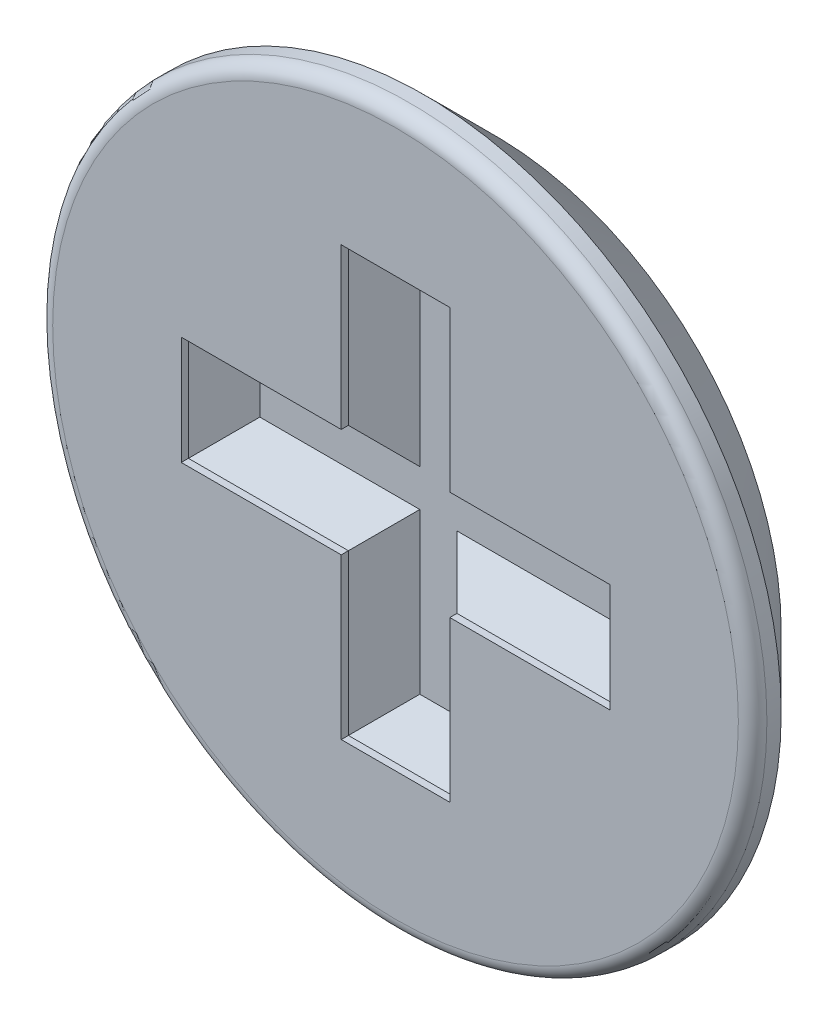
ISO-10303-21;
HEADER;
FILE_DESCRIPTION(('STEP AP214'),'2;1');
FILE_NAME('part.step','',(''),(''),'','','');
FILE_SCHEMA(('AUTOMOTIVE_DESIGN { 1 0 10303 214 1 1 1 1 }'));
ENDSEC;
DATA;
#1=APPLICATION_CONTEXT('core data for automotive mechanical design processes');
#2=APPLICATION_PROTOCOL_DEFINITION('international standard','automotive_design',2000,#1);
#3=PRODUCT_CONTEXT('',#1,'mechanical');
#4=PRODUCT('Part','Part','',(#3));
#5=PRODUCT_RELATED_PRODUCT_CATEGORY('part','',(#4));
#6=PRODUCT_DEFINITION_FORMATION('','',#4);
#7=PRODUCT_DEFINITION_CONTEXT('part definition',#1,'design');
#8=PRODUCT_DEFINITION('design','',#6,#7);
#9=PRODUCT_DEFINITION_SHAPE('','',#8);
#10=(LENGTH_UNIT() NAMED_UNIT(*) SI_UNIT(.MILLI.,.METRE.));
#11=(NAMED_UNIT(*) PLANE_ANGLE_UNIT() SI_UNIT($,.RADIAN.));
#12=(NAMED_UNIT(*) SI_UNIT($,.STERADIAN.) SOLID_ANGLE_UNIT());
#13=UNCERTAINTY_MEASURE_WITH_UNIT(LENGTH_MEASURE(1.E-05),#10,'distance_accuracy_value','');
#14=(GEOMETRIC_REPRESENTATION_CONTEXT(3) GLOBAL_UNCERTAINTY_ASSIGNED_CONTEXT((#13)) GLOBAL_UNIT_ASSIGNED_CONTEXT((#10,
#11,#12)) REPRESENTATION_CONTEXT('',''));
#15=CARTESIAN_POINT('',(0.,0.,0.));
#16=DIRECTION('',(0.,0.,1.));
#17=DIRECTION('',(1.,0.,0.));
#18=AXIS2_PLACEMENT_3D('',#15,#16,#17);
#19=CARTESIAN_POINT('',(-0.625,-0.625,0.2));
#20=DIRECTION('',(0.,0.,1.));
#21=DIRECTION('',(1.,0.,0.));
#22=AXIS2_PLACEMENT_3D('',#19,#20,#21);
#23=PLANE('',#22);
#24=DIRECTION('',(1.,0.,0.));
#25=VECTOR('',#24,1.);
#26=CARTESIAN_POINT('',(-0.4075,-0.065,0.2));
#27=LINE('',#26,#25);
#28=CARTESIAN_POINT('',(-0.6249999999524,-0.065,0.2));
#29=VERTEX_POINT('',#28);
#30=CARTESIAN_POINT('',(-0.065,-0.0649999999575301,0.2));
#31=VERTEX_POINT('',#30);
#32=EDGE_CURVE('E221',#29,#31,#27,.T.);
#33=ORIENTED_EDGE('',*,*,#32,.T.);
#34=DIRECTION('',(0.,-1.,0.));
#35=VECTOR('',#34,1.);
#36=CARTESIAN_POINT('',(-0.065,-0.4075,0.2));
#37=LINE('',#36,#35);
#38=CARTESIAN_POINT('',(-0.06499999994095,-0.625,0.2));
#39=VERTEX_POINT('',#38);
#40=EDGE_CURVE('E213',#31,#39,#37,.T.);
#41=ORIENTED_EDGE('',*,*,#40,.T.);
#42=DIRECTION('',(1.,0.,0.));
#43=VECTOR('',#42,1.);
#44=CARTESIAN_POINT('',(0.,-0.625,0.2));
#45=LINE('',#44,#43);
#46=CARTESIAN_POINT('',(0.065,-0.6249999999524,0.2));
#47=VERTEX_POINT('',#46);
#48=EDGE_CURVE('E205',#39,#47,#45,.T.);
#49=ORIENTED_EDGE('',*,*,#48,.T.);
#50=DIRECTION('',(0.,1.,0.));
#51=VECTOR('',#50,1.);
#52=CARTESIAN_POINT('',(0.065,-0.4075,0.2));
#53=LINE('',#52,#51);
#54=CARTESIAN_POINT('',(0.0649999999575301,-0.065,0.2));
#55=VERTEX_POINT('',#54);
#56=EDGE_CURVE('E197',#47,#55,#53,.T.);
#57=ORIENTED_EDGE('',*,*,#56,.T.);
#58=DIRECTION('',(1.,0.,0.));
#59=VECTOR('',#58,1.);
#60=CARTESIAN_POINT('',(0.4075,-0.065,0.2));
#61=LINE('',#60,#59);
#62=CARTESIAN_POINT('',(0.625,-0.06499999994095,0.2));
#63=VERTEX_POINT('',#62);
#64=EDGE_CURVE('E189',#55,#63,#61,.T.);
#65=ORIENTED_EDGE('',*,*,#64,.T.);
#66=DIRECTION('',(0.,1.,0.));
#67=VECTOR('',#66,1.);
#68=CARTESIAN_POINT('',(0.625,0.,0.2));
#69=LINE('',#68,#67);
#70=CARTESIAN_POINT('',(0.6249999999524,0.065,0.2));
#71=VERTEX_POINT('',#70);
#72=EDGE_CURVE('E181',#63,#71,#69,.T.);
#73=ORIENTED_EDGE('',*,*,#72,.T.);
#74=DIRECTION('',(-1.,0.,0.));
#75=VECTOR('',#74,1.);
#76=CARTESIAN_POINT('',(0.4075,0.065,0.2));
#77=LINE('',#76,#75);
#78=CARTESIAN_POINT('',(0.065,0.0649999999575301,0.2));
#79=VERTEX_POINT('',#78);
#80=EDGE_CURVE('E163',#71,#79,#77,.T.);
#81=ORIENTED_EDGE('',*,*,#80,.T.);
#82=DIRECTION('',(0.,1.,0.));
#83=VECTOR('',#82,1.);
#84=CARTESIAN_POINT('',(0.065,0.4075,0.2));
#85=LINE('',#84,#83);
#86=CARTESIAN_POINT('',(0.06499999994095,0.625,0.2));
#87=VERTEX_POINT('',#86);
#88=EDGE_CURVE('E144',#79,#87,#85,.T.);
#89=ORIENTED_EDGE('',*,*,#88,.T.);
#90=DIRECTION('',(-1.,0.,0.));
#91=VECTOR('',#90,1.);
#92=CARTESIAN_POINT('',(0.,0.625,0.2));
#93=LINE('',#92,#91);
#94=CARTESIAN_POINT('',(-0.065,0.6249999999524,0.2));
#95=VERTEX_POINT('',#94);
#96=EDGE_CURVE('E139',#87,#95,#93,.T.);
#97=ORIENTED_EDGE('',*,*,#96,.T.);
#98=DIRECTION('',(0.,-1.,0.));
#99=VECTOR('',#98,1.);
#100=CARTESIAN_POINT('',(-0.065,0.4075,0.2));
#101=LINE('',#100,#99);
#102=CARTESIAN_POINT('',(-0.065,0.06499999995753,0.2));
#103=VERTEX_POINT('',#102);
#104=EDGE_CURVE('E141',#95,#103,#101,.T.);
#105=ORIENTED_EDGE('',*,*,#104,.T.);
#106=DIRECTION('',(-1.,0.,0.));
#107=VECTOR('',#106,1.);
#108=CARTESIAN_POINT('',(-0.4075,0.065,0.2));
#109=LINE('',#108,#107);
#110=CARTESIAN_POINT('',(-0.625,0.06499999994095,0.2));
#111=VERTEX_POINT('',#110);
#112=EDGE_CURVE('E237',#103,#111,#109,.T.);
#113=ORIENTED_EDGE('',*,*,#112,.T.);
#114=DIRECTION('',(0.,-1.,0.));
#115=VECTOR('',#114,1.);
#116=CARTESIAN_POINT('',(-0.625,0.,0.2));
#117=LINE('',#116,#115);
#118=EDGE_CURVE('E229',#111,#29,#117,.T.);
#119=ORIENTED_EDGE('',*,*,#118,.T.);
#120=EDGE_LOOP('',(#33,#41,#49,#57,#65,#73,#81,#89,#97,#105,#113,#119));
#121=FACE_BOUND('',#120,.T.);
#122=ADVANCED_FACE('F16',(#121),#23,.T.);
#123=CARTESIAN_POINT('',(-1.012,-1.012,0.));
#124=DIRECTION('',(0.,0.,1.));
#125=DIRECTION('',(1.,0.,0.));
#126=AXIS2_PLACEMENT_3D('',#123,#124,#125);
#127=PLANE('',#126);
#128=CARTESIAN_POINT('',(0.,0.,0.));
#129=DIRECTION('',(0.,0.,1.));
#130=DIRECTION('',(1.,0.,0.));
#131=AXIS2_PLACEMENT_3D('',#128,#129,#130);
#132=CIRCLE('',#131,1.);
#133=CARTESIAN_POINT('',(1.,0.,0.));
#134=VERTEX_POINT('',#133);
#135=EDGE_CURVE('E247',#134,#134,#132,.F.);
#136=ORIENTED_EDGE('',*,*,#135,.T.);
#137=EDGE_LOOP('',(#136));
#138=FACE_BOUND('',#137,.T.);
#139=ADVANCED_FACE('F430',(#138),#127,.F.);
#140=CARTESIAN_POINT('',(-0.065,0.06089,0.2));
#141=DIRECTION('',(-0.707106781186548,0.,-0.707106781186547));
#142=DIRECTION('',(-0.707106781186547,0.,0.707106781186548));
#143=AXIS2_PLACEMENT_3D('',#140,#141,#142);
#144=PLANE('',#143);
#145=DIRECTION('',(0.,-1.,0.));
#146=VECTOR('',#145,1.);
#147=CARTESIAN_POINT('',(-0.19,0.47,0.325));
#148=LINE('',#147,#146);
#149=CARTESIAN_POINT('',(-0.19,0.75000000002356,0.325));
#150=VERTEX_POINT('',#149);
#151=CARTESIAN_POINT('',(-0.19,0.19000000005905,0.325));
#152=VERTEX_POINT('',#151);
#153=EDGE_CURVE('E250',#150,#152,#148,.T.);
#154=ORIENTED_EDGE('',*,*,#153,.T.);
#155=DIRECTION('',(0.577350268877025,-0.577350269814827,-0.577350268877026));
#156=VECTOR('',#155,1.);
#157=CARTESIAN_POINT('',(-0.1899999998819,0.19,0.3249999998819));
#158=LINE('',#157,#156);
#159=EDGE_CURVE('E154',#152,#103,#158,.T.);
#160=ORIENTED_EDGE('',*,*,#159,.T.);
#161=ORIENTED_EDGE('',*,*,#104,.F.);
#162=DIRECTION('',(-0.57735026897051,0.577350269627857,0.57735026897051));
#163=VECTOR('',#162,1.);
#164=CARTESIAN_POINT('',(-0.0650000000952,0.625,0.2000000000952));
#165=LINE('',#164,#163);
#166=EDGE_CURVE('E20',#95,#150,#165,.T.);
#167=ORIENTED_EDGE('',*,*,#166,.T.);
#168=EDGE_LOOP('',(#154,#160,#161,#167));
#169=FACE_BOUND('',#168,.T.);
#170=ADVANCED_FACE('F151',(#169),#144,.F.);
#171=CARTESIAN_POINT('',(-0.19228,0.625,0.2));
#172=DIRECTION('',(0.,0.707106781186548,-0.707106781186547));
#173=DIRECTION('',(0.,0.707106781186547,0.707106781186548));
#174=AXIS2_PLACEMENT_3D('',#171,#172,#173);
#175=PLANE('',#174);
#176=ORIENTED_EDGE('',*,*,#96,.F.);
#177=DIRECTION('',(0.577350269814827,0.577350268877025,0.577350268877025));
#178=VECTOR('',#177,1.);
#179=CARTESIAN_POINT('',(0.065,0.6250000001181,0.2000000001181));
#180=LINE('',#179,#178);
#181=CARTESIAN_POINT('',(0.19000000004247,0.75,0.325));
#182=VERTEX_POINT('',#181);
#183=EDGE_CURVE('E161',#87,#182,#180,.T.);
#184=ORIENTED_EDGE('',*,*,#183,.T.);
#185=DIRECTION('',(-1.,0.,0.));
#186=VECTOR('',#185,1.);
#187=CARTESIAN_POINT('',(0.,0.75,0.325));
#188=LINE('',#187,#186);
#189=EDGE_CURVE('E159',#182,#150,#188,.T.);
#190=ORIENTED_EDGE('',*,*,#189,.T.);
#191=ORIENTED_EDGE('',*,*,#166,.F.);
#192=EDGE_LOOP('',(#176,#184,#190,#191));
#193=FACE_BOUND('',#192,.T.);
#194=ADVANCED_FACE('F157',(#193),#175,.F.);
#195=CARTESIAN_POINT('',(0.19,0.06089,0.325));
#196=DIRECTION('',(0.707106781186548,0.,-0.707106781186547));
#197=DIRECTION('',(-0.707106781186547,0.,-0.707106781186548));
#198=AXIS2_PLACEMENT_3D('',#195,#196,#197);
#199=PLANE('',#198);
#200=ORIENTED_EDGE('',*,*,#88,.F.);
#201=DIRECTION('',(0.577350268877025,0.577350269814827,0.577350268877026));
#202=VECTOR('',#201,1.);
#203=CARTESIAN_POINT('',(0.06500000008494,0.065,0.20000000008494));
#204=LINE('',#203,#202);
#205=CARTESIAN_POINT('',(0.19,0.19000000005905,0.325));
#206=VERTEX_POINT('',#205);
#207=EDGE_CURVE('E175',#79,#206,#204,.T.);
#208=ORIENTED_EDGE('',*,*,#207,.T.);
#209=DIRECTION('',(0.,1.,0.));
#210=VECTOR('',#209,1.);
#211=CARTESIAN_POINT('',(0.19,0.47,0.325));
#212=LINE('',#211,#210);
#213=EDGE_CURVE('E168',#206,#182,#212,.T.);
#214=ORIENTED_EDGE('',*,*,#213,.T.);
#215=ORIENTED_EDGE('',*,*,#183,.F.);
#216=EDGE_LOOP('',(#200,#208,#214,#215));
#217=FACE_BOUND('',#216,.T.);
#218=ADVANCED_FACE('F262',(#217),#199,.F.);
#219=CARTESIAN_POINT('',(0.06089,0.065,0.2));
#220=DIRECTION('',(0.,0.707106781186548,-0.707106781186547));
#221=DIRECTION('',(0.,0.707106781186547,0.707106781186548));
#222=AXIS2_PLACEMENT_3D('',#219,#220,#221);
#223=PLANE('',#222);
#224=ORIENTED_EDGE('',*,*,#80,.F.);
#225=DIRECTION('',(0.577350269627858,0.57735026897051,0.57735026897051));
#226=VECTOR('',#225,1.);
#227=CARTESIAN_POINT('',(0.625,0.0650000000952,0.2000000000952));
#228=LINE('',#227,#226);
#229=CARTESIAN_POINT('',(0.75000000002356,0.19,0.325));
#230=VERTEX_POINT('',#229);
#231=EDGE_CURVE('E183',#71,#230,#228,.T.);
#232=ORIENTED_EDGE('',*,*,#231,.T.);
#233=DIRECTION('',(-1.,0.,0.));
#234=VECTOR('',#233,1.);
#235=CARTESIAN_POINT('',(0.47,0.19,0.325));
#236=LINE('',#235,#234);
#237=EDGE_CURVE('E173',#230,#206,#236,.T.);
#238=ORIENTED_EDGE('',*,*,#237,.T.);
#239=ORIENTED_EDGE('',*,*,#207,.F.);
#240=EDGE_LOOP('',(#224,#232,#238,#239));
#241=FACE_BOUND('',#240,.T.);
#242=ADVANCED_FACE('F267',(#241),#223,.F.);
#243=CARTESIAN_POINT('',(0.75,-0.19228,0.325));
#244=DIRECTION('',(0.707106781186548,0.,-0.707106781186547));
#245=DIRECTION('',(-0.707106781186547,0.,-0.707106781186548));
#246=AXIS2_PLACEMENT_3D('',#243,#244,#245);
#247=PLANE('',#246);
#248=ORIENTED_EDGE('',*,*,#72,.F.);
#249=DIRECTION('',(0.577350268877025,-0.577350269814827,0.577350268877025));
#250=VECTOR('',#249,1.);
#251=CARTESIAN_POINT('',(0.6250000001181,-0.065,0.2000000001181));
#252=LINE('',#251,#250);
#253=CARTESIAN_POINT('',(0.75,-0.19000000004247,0.325));
#254=VERTEX_POINT('',#253);
#255=EDGE_CURVE('E191',#63,#254,#252,.T.);
#256=ORIENTED_EDGE('',*,*,#255,.T.);
#257=DIRECTION('',(0.,1.,0.));
#258=VECTOR('',#257,1.);
#259=CARTESIAN_POINT('',(0.75,0.,0.325));
#260=LINE('',#259,#258);
#261=EDGE_CURVE('E180',#254,#230,#260,.T.);
#262=ORIENTED_EDGE('',*,*,#261,.T.);
#263=ORIENTED_EDGE('',*,*,#231,.F.);
#264=EDGE_LOOP('',(#248,#256,#262,#263));
#265=FACE_BOUND('',#264,.T.);
#266=ADVANCED_FACE('F390',(#265),#247,.F.);
#267=CARTESIAN_POINT('',(0.06089,-0.19,0.325));
#268=DIRECTION('',(0.,-0.707106781186548,-0.707106781186547));
#269=DIRECTION('',(0.,0.707106781186547,-0.707106781186548));
#270=AXIS2_PLACEMENT_3D('',#267,#268,#269);
#271=PLANE('',#270);
#272=ORIENTED_EDGE('',*,*,#64,.F.);
#273=DIRECTION('',(0.577350269814827,-0.577350268877025,0.577350268877026));
#274=VECTOR('',#273,1.);
#275=CARTESIAN_POINT('',(0.065,-0.06500000008494,0.20000000008494));
#276=LINE('',#275,#274);
#277=CARTESIAN_POINT('',(0.19000000005905,-0.19,0.325));
#278=VERTEX_POINT('',#277);
#279=EDGE_CURVE('E199',#55,#278,#276,.T.);
#280=ORIENTED_EDGE('',*,*,#279,.T.);
#281=DIRECTION('',(1.,0.,0.));
#282=VECTOR('',#281,1.);
#283=CARTESIAN_POINT('',(0.47,-0.19,0.325));
#284=LINE('',#283,#282);
#285=EDGE_CURVE('E188',#278,#254,#284,.T.);
#286=ORIENTED_EDGE('',*,*,#285,.T.);
#287=ORIENTED_EDGE('',*,*,#255,.F.);
#288=EDGE_LOOP('',(#272,#280,#286,#287));
#289=FACE_BOUND('',#288,.T.);
#290=ADVANCED_FACE('F388',(#289),#271,.F.);
#291=CARTESIAN_POINT('',(0.19,-0.75411,0.325));
#292=DIRECTION('',(0.707106781186548,0.,-0.707106781186547));
#293=DIRECTION('',(-0.707106781186547,0.,-0.707106781186548));
#294=AXIS2_PLACEMENT_3D('',#291,#292,#293);
#295=PLANE('',#294);
#296=DIRECTION('',(0.,1.,0.));
#297=VECTOR('',#296,1.);
#298=CARTESIAN_POINT('',(0.19,-0.47,0.325));
#299=LINE('',#298,#297);
#300=CARTESIAN_POINT('',(0.19,-0.75000000002356,0.325));
#301=VERTEX_POINT('',#300);
#302=EDGE_CURVE('E196',#301,#278,#299,.T.);
#303=ORIENTED_EDGE('',*,*,#302,.T.);
#304=ORIENTED_EDGE('',*,*,#279,.F.);
#305=ORIENTED_EDGE('',*,*,#56,.F.);
#306=DIRECTION('',(0.57735026897051,-0.577350269627858,0.57735026897051));
#307=VECTOR('',#306,1.);
#308=CARTESIAN_POINT('',(0.0650000000952,-0.625,0.2000000000952));
#309=LINE('',#308,#307);
#310=EDGE_CURVE('E207',#47,#301,#309,.T.);
#311=ORIENTED_EDGE('',*,*,#310,.T.);
#312=EDGE_LOOP('',(#303,#304,#305,#311));
#313=FACE_BOUND('',#312,.T.);
#314=ADVANCED_FACE('F382',(#313),#295,.F.);
#315=CARTESIAN_POINT('',(-0.19228,-0.75,0.325));
#316=DIRECTION('',(0.,-0.707106781186548,-0.707106781186547));
#317=DIRECTION('',(0.,0.707106781186547,-0.707106781186548));
#318=AXIS2_PLACEMENT_3D('',#315,#316,#317);
#319=PLANE('',#318);
#320=DIRECTION('',(1.,0.,0.));
#321=VECTOR('',#320,1.);
#322=CARTESIAN_POINT('',(0.,-0.75,0.325));
#323=LINE('',#322,#321);
#324=CARTESIAN_POINT('',(-0.19000000004247,-0.75,0.325));
#325=VERTEX_POINT('',#324);
#326=EDGE_CURVE('E204',#325,#301,#323,.T.);
#327=ORIENTED_EDGE('',*,*,#326,.T.);
#328=ORIENTED_EDGE('',*,*,#310,.F.);
#329=ORIENTED_EDGE('',*,*,#48,.F.);
#330=DIRECTION('',(-0.577350269814827,-0.577350268877025,0.577350268877025));
#331=VECTOR('',#330,1.);
#332=CARTESIAN_POINT('',(-0.065,-0.6250000001181,0.2000000001181));
#333=LINE('',#332,#331);
#334=EDGE_CURVE('E215',#39,#325,#333,.T.);
#335=ORIENTED_EDGE('',*,*,#334,.T.);
#336=EDGE_LOOP('',(#327,#328,#329,#335));
#337=FACE_BOUND('',#336,.T.);
#338=ADVANCED_FACE('F380',(#337),#319,.F.);
#339=CARTESIAN_POINT('',(-0.065,-0.75411,0.2));
#340=DIRECTION('',(-0.707106781186548,0.,-0.707106781186547));
#341=DIRECTION('',(-0.707106781186547,0.,0.707106781186548));
#342=AXIS2_PLACEMENT_3D('',#339,#340,#341);
#343=PLANE('',#342);
#344=DIRECTION('',(0.,-1.,0.));
#345=VECTOR('',#344,1.);
#346=CARTESIAN_POINT('',(-0.19,-0.47,0.325));
#347=LINE('',#346,#345);
#348=CARTESIAN_POINT('',(-0.19,-0.19000000005905,0.325));
#349=VERTEX_POINT('',#348);
#350=EDGE_CURVE('E212',#349,#325,#347,.T.);
#351=ORIENTED_EDGE('',*,*,#350,.T.);
#352=ORIENTED_EDGE('',*,*,#334,.F.);
#353=ORIENTED_EDGE('',*,*,#40,.F.);
#354=DIRECTION('',(-0.577350268877025,-0.577350269814827,0.577350268877026));
#355=VECTOR('',#354,1.);
#356=CARTESIAN_POINT('',(-0.06500000008494,-0.0650000000000001,0.20000000008494));
#357=LINE('',#356,#355);
#358=EDGE_CURVE('E223',#31,#349,#357,.T.);
#359=ORIENTED_EDGE('',*,*,#358,.T.);
#360=EDGE_LOOP('',(#351,#352,#353,#359));
#361=FACE_BOUND('',#360,.T.);
#362=ADVANCED_FACE('F374',(#361),#343,.F.);
#363=CARTESIAN_POINT('',(-0.75411,-0.19,0.325));
#364=DIRECTION('',(0.,-0.707106781186548,-0.707106781186547));
#365=DIRECTION('',(0.,0.707106781186547,-0.707106781186548));
#366=AXIS2_PLACEMENT_3D('',#363,#364,#365);
#367=PLANE('',#366);
#368=DIRECTION('',(1.,0.,0.));
#369=VECTOR('',#368,1.);
#370=CARTESIAN_POINT('',(-0.47,-0.19,0.325));
#371=LINE('',#370,#369);
#372=CARTESIAN_POINT('',(-0.75000000002356,-0.19,0.325));
#373=VERTEX_POINT('',#372);
#374=EDGE_CURVE('E220',#373,#349,#371,.T.);
#375=ORIENTED_EDGE('',*,*,#374,.T.);
#376=ORIENTED_EDGE('',*,*,#358,.F.);
#377=ORIENTED_EDGE('',*,*,#32,.F.);
#378=DIRECTION('',(-0.577350269627857,-0.57735026897051,0.57735026897051));
#379=VECTOR('',#378,1.);
#380=CARTESIAN_POINT('',(-0.625,-0.0650000000952,0.2000000000952));
#381=LINE('',#380,#379);
#382=EDGE_CURVE('E231',#29,#373,#381,.T.);
#383=ORIENTED_EDGE('',*,*,#382,.T.);
#384=EDGE_LOOP('',(#375,#376,#377,#383));
#385=FACE_BOUND('',#384,.T.);
#386=ADVANCED_FACE('F372',(#385),#367,.F.);
#387=CARTESIAN_POINT('',(-0.625,-0.19228,0.2));
#388=DIRECTION('',(-0.707106781186548,0.,-0.707106781186547));
#389=DIRECTION('',(-0.707106781186547,0.,0.707106781186548));
#390=AXIS2_PLACEMENT_3D('',#387,#388,#389);
#391=PLANE('',#390);
#392=DIRECTION('',(0.,-1.,0.));
#393=VECTOR('',#392,1.);
#394=CARTESIAN_POINT('',(-0.75,0.,0.325));
#395=LINE('',#394,#393);
#396=CARTESIAN_POINT('',(-0.75,0.19000000004247,0.325));
#397=VERTEX_POINT('',#396);
#398=EDGE_CURVE('E228',#397,#373,#395,.T.);
#399=ORIENTED_EDGE('',*,*,#398,.T.);
#400=ORIENTED_EDGE('',*,*,#382,.F.);
#401=ORIENTED_EDGE('',*,*,#118,.F.);
#402=DIRECTION('',(-0.577350268877025,0.577350269814827,0.577350268877025));
#403=VECTOR('',#402,1.);
#404=CARTESIAN_POINT('',(-0.6250000001181,0.065,0.2000000001181));
#405=LINE('',#404,#403);
#406=EDGE_CURVE('E239',#111,#397,#405,.T.);
#407=ORIENTED_EDGE('',*,*,#406,.T.);
#408=EDGE_LOOP('',(#399,#400,#401,#407));
#409=FACE_BOUND('',#408,.T.);
#410=ADVANCED_FACE('F366',(#409),#391,.F.);
#411=CARTESIAN_POINT('',(-0.75411,0.065,0.2));
#412=DIRECTION('',(0.,0.707106781186548,-0.707106781186547));
#413=DIRECTION('',(0.,0.707106781186547,0.707106781186548));
#414=AXIS2_PLACEMENT_3D('',#411,#412,#413);
#415=PLANE('',#414);
#416=DIRECTION('',(-1.,0.,0.));
#417=VECTOR('',#416,1.);
#418=CARTESIAN_POINT('',(-0.47,0.19,0.325));
#419=LINE('',#418,#417);
#420=EDGE_CURVE('E240',#152,#397,#419,.T.);
#421=ORIENTED_EDGE('',*,*,#420,.T.);
#422=ORIENTED_EDGE('',*,*,#406,.F.);
#423=ORIENTED_EDGE('',*,*,#112,.F.);
#424=ORIENTED_EDGE('',*,*,#159,.F.);
#425=EDGE_LOOP('',(#421,#422,#423,#424));
#426=FACE_BOUND('',#425,.T.);
#427=ADVANCED_FACE('F313',(#426),#415,.F.);
#428=CARTESIAN_POINT('',(0.,0.,0.));
#429=DIRECTION('',(0.,0.,1.));
#430=DIRECTION('',(1.,0.,0.));
#431=AXIS2_PLACEMENT_3D('',#428,#429,#430);
#432=CONICAL_SURFACE('',#431,1.,0.785398163397448);
#433=ORIENTED_EDGE('',*,*,#135,.F.);
#434=EDGE_LOOP('',(#433));
#435=FACE_BOUND('',#434,.T.);
#436=CARTESIAN_POINT('',(0.,0.,0.25));
#437=DIRECTION('',(0.,0.,-1.));
#438=DIRECTION('',(-1.,0.,0.));
#439=AXIS2_PLACEMENT_3D('',#436,#437,#438);
#440=CIRCLE('',#439,1.25);
#441=CARTESIAN_POINT('',(-1.25,0.,0.25));
#442=VERTEX_POINT('',#441);
#443=EDGE_CURVE('E244',#442,#442,#440,.T.);
#444=ORIENTED_EDGE('',*,*,#443,.T.);
#445=EDGE_LOOP('',(#444));
#446=FACE_BOUND('',#445,.T.);
#447=ADVANCED_FACE('F415',(#435,#446),#432,.T.);
#448=CARTESIAN_POINT('',(-0.19,0.75,0.325));
#449=DIRECTION('',(-1.,0.,0.));
#450=DIRECTION('',(0.,-1.,0.));
#451=AXIS2_PLACEMENT_3D('',#448,#449,#450);
#452=PLANE('',#451);
#453=ORIENTED_EDGE('',*,*,#153,.F.);
#454=DIRECTION('',(0.,0.,1.));
#455=VECTOR('',#454,1.);
#456=CARTESIAN_POINT('',(-0.19,0.75,0.3375));
#457=LINE('',#456,#455);
#458=CARTESIAN_POINT('',(-0.1899999997032,0.7499999997552,0.35));
#459=VERTEX_POINT('',#458);
#460=EDGE_CURVE('E166',#150,#459,#457,.T.);
#461=ORIENTED_EDGE('',*,*,#460,.T.);
#462=DIRECTION('',(0.,1.,0.));
#463=VECTOR('',#462,1.);
#464=CARTESIAN_POINT('',(-0.1899999988128,0.,0.35));
#465=LINE('',#464,#463);
#466=CARTESIAN_POINT('',(-0.1899999997032,0.1899999997032,0.35));
#467=VERTEX_POINT('',#466);
#468=EDGE_CURVE('E295',#467,#459,#465,.T.);
#469=ORIENTED_EDGE('',*,*,#468,.F.);
#470=DIRECTION('',(0.,0.,-1.));
#471=VECTOR('',#470,1.);
#472=CARTESIAN_POINT('',(-0.19,0.19,0.3375));
#473=LINE('',#472,#471);
#474=EDGE_CURVE('E236',#467,#152,#473,.T.);
#475=ORIENTED_EDGE('',*,*,#474,.T.);
#476=EDGE_LOOP('',(#453,#461,#469,#475));
#477=FACE_BOUND('',#476,.T.);
#478=ADVANCED_FACE('F308',(#477),#452,.F.);
#479=CARTESIAN_POINT('',(-0.19,0.75,0.325));
#480=DIRECTION('',(0.,1.,0.));
#481=DIRECTION('',(0.,0.,1.));
#482=AXIS2_PLACEMENT_3D('',#479,#480,#481);
#483=PLANE('',#482);
#484=ORIENTED_EDGE('',*,*,#189,.F.);
#485=DIRECTION('',(0.,0.,1.));
#486=VECTOR('',#485,1.);
#487=CARTESIAN_POINT('',(0.19,0.75,0.3375));
#488=LINE('',#487,#486);
#489=CARTESIAN_POINT('',(0.1899999997032,0.7499999997552,0.35));
#490=VERTEX_POINT('',#489);
#491=EDGE_CURVE('E171',#182,#490,#488,.T.);
#492=ORIENTED_EDGE('',*,*,#491,.T.);
#493=DIRECTION('',(1.,0.,0.));
#494=VECTOR('',#493,1.);
#495=CARTESIAN_POINT('',(0.,0.7499999990208,0.35));
#496=LINE('',#495,#494);
#497=EDGE_CURVE('E293',#459,#490,#496,.T.);
#498=ORIENTED_EDGE('',*,*,#497,.F.);
#499=ORIENTED_EDGE('',*,*,#460,.F.);
#500=EDGE_LOOP('',(#484,#492,#498,#499));
#501=FACE_BOUND('',#500,.T.);
#502=ADVANCED_FACE('F423',(#501),#483,.F.);
#503=CARTESIAN_POINT('',(0.19,0.19,0.325));
#504=DIRECTION('',(1.,0.,0.));
#505=DIRECTION('',(0.,1.,0.));
#506=AXIS2_PLACEMENT_3D('',#503,#504,#505);
#507=PLANE('',#506);
#508=ORIENTED_EDGE('',*,*,#213,.F.);
#509=DIRECTION('',(0.,0.,1.));
#510=VECTOR('',#509,1.);
#511=CARTESIAN_POINT('',(0.19,0.19,0.3375));
#512=LINE('',#511,#510);
#513=CARTESIAN_POINT('',(0.1899999997032,0.1899999997032,0.35));
#514=VERTEX_POINT('',#513);
#515=EDGE_CURVE('E178',#206,#514,#512,.T.);
#516=ORIENTED_EDGE('',*,*,#515,.T.);
#517=DIRECTION('',(0.,-1.,0.));
#518=VECTOR('',#517,1.);
#519=CARTESIAN_POINT('',(0.1899999988128,0.,0.35));
#520=LINE('',#519,#518);
#521=EDGE_CURVE('E285',#490,#514,#520,.T.);
#522=ORIENTED_EDGE('',*,*,#521,.F.);
#523=ORIENTED_EDGE('',*,*,#491,.F.);
#524=EDGE_LOOP('',(#508,#516,#522,#523));
#525=FACE_BOUND('',#524,.T.);
#526=ADVANCED_FACE('F274',(#525),#507,.F.);
#527=CARTESIAN_POINT('',(0.75,0.19,0.325));
#528=DIRECTION('',(0.,1.,0.));
#529=DIRECTION('',(-1.,0.,0.));
#530=AXIS2_PLACEMENT_3D('',#527,#528,#529);
#531=PLANE('',#530);
#532=ORIENTED_EDGE('',*,*,#237,.F.);
#533=DIRECTION('',(0.,0.,1.));
#534=VECTOR('',#533,1.);
#535=CARTESIAN_POINT('',(0.75,0.19,0.3375));
#536=LINE('',#535,#534);
#537=CARTESIAN_POINT('',(0.7499999997552,0.1899999997032,0.35));
#538=VERTEX_POINT('',#537);
#539=EDGE_CURVE('E186',#230,#538,#536,.T.);
#540=ORIENTED_EDGE('',*,*,#539,.T.);
#541=DIRECTION('',(1.,0.,0.));
#542=VECTOR('',#541,1.);
#543=CARTESIAN_POINT('',(0.,0.1899999988128,0.35));
#544=LINE('',#543,#542);
#545=EDGE_CURVE('E279',#514,#538,#544,.T.);
#546=ORIENTED_EDGE('',*,*,#545,.F.);
#547=ORIENTED_EDGE('',*,*,#515,.F.);
#548=EDGE_LOOP('',(#532,#540,#546,#547));
#549=FACE_BOUND('',#548,.T.);
#550=ADVANCED_FACE('F277',(#549),#531,.F.);
#551=CARTESIAN_POINT('',(0.75,-0.19,0.35));
#552=DIRECTION('',(1.,0.,0.));
#553=DIRECTION('',(0.,0.,-1.));
#554=AXIS2_PLACEMENT_3D('',#551,#552,#553);
#555=PLANE('',#554);
#556=ORIENTED_EDGE('',*,*,#261,.F.);
#557=DIRECTION('',(0.,0.,1.));
#558=VECTOR('',#557,1.);
#559=CARTESIAN_POINT('',(0.75,-0.19,0.3375));
#560=LINE('',#559,#558);
#561=CARTESIAN_POINT('',(0.7499999997552,-0.1899999997032,0.35));
#562=VERTEX_POINT('',#561);
#563=EDGE_CURVE('E194',#254,#562,#560,.T.);
#564=ORIENTED_EDGE('',*,*,#563,.T.);
#565=DIRECTION('',(0.,-1.,0.));
#566=VECTOR('',#565,1.);
#567=CARTESIAN_POINT('',(0.7499999990208,0.,0.35));
#568=LINE('',#567,#566);
#569=EDGE_CURVE('E284',#538,#562,#568,.T.);
#570=ORIENTED_EDGE('',*,*,#569,.F.);
#571=ORIENTED_EDGE('',*,*,#539,.F.);
#572=EDGE_LOOP('',(#556,#564,#570,#571));
#573=FACE_BOUND('',#572,.T.);
#574=ADVANCED_FACE('F339',(#573),#555,.F.);
#575=CARTESIAN_POINT('',(0.19,-0.19,0.325));
#576=DIRECTION('',(0.,-1.,0.));
#577=DIRECTION('',(1.,0.,0.));
#578=AXIS2_PLACEMENT_3D('',#575,#576,#577);
#579=PLANE('',#578);
#580=ORIENTED_EDGE('',*,*,#285,.F.);
#581=DIRECTION('',(0.,0.,1.));
#582=VECTOR('',#581,1.);
#583=CARTESIAN_POINT('',(0.19,-0.19,0.3375));
#584=LINE('',#583,#582);
#585=CARTESIAN_POINT('',(0.1899999997032,-0.1899999997032,0.35));
#586=VERTEX_POINT('',#585);
#587=EDGE_CURVE('E202',#278,#586,#584,.T.);
#588=ORIENTED_EDGE('',*,*,#587,.T.);
#589=DIRECTION('',(-1.,0.,0.));
#590=VECTOR('',#589,1.);
#591=CARTESIAN_POINT('',(0.,-0.1899999988128,0.35));
#592=LINE('',#591,#590);
#593=EDGE_CURVE('E334',#562,#586,#592,.T.);
#594=ORIENTED_EDGE('',*,*,#593,.F.);
#595=ORIENTED_EDGE('',*,*,#563,.F.);
#596=EDGE_LOOP('',(#580,#588,#594,#595));
#597=FACE_BOUND('',#596,.T.);
#598=ADVANCED_FACE('F343',(#597),#579,.F.);
#599=CARTESIAN_POINT('',(0.19,-0.75,0.325));
#600=DIRECTION('',(1.,0.,0.));
#601=DIRECTION('',(0.,1.,0.));
#602=AXIS2_PLACEMENT_3D('',#599,#600,#601);
#603=PLANE('',#602);
#604=ORIENTED_EDGE('',*,*,#302,.F.);
#605=DIRECTION('',(0.,0.,1.));
#606=VECTOR('',#605,1.);
#607=CARTESIAN_POINT('',(0.19,-0.75,0.3375));
#608=LINE('',#607,#606);
#609=CARTESIAN_POINT('',(0.1899999997032,-0.7499999997552,0.35));
#610=VERTEX_POINT('',#609);
#611=EDGE_CURVE('E210',#301,#610,#608,.T.);
#612=ORIENTED_EDGE('',*,*,#611,.T.);
#613=DIRECTION('',(0.,-1.,0.));
#614=VECTOR('',#613,1.);
#615=CARTESIAN_POINT('',(0.1899999988128,0.,0.35));
#616=LINE('',#615,#614);
#617=EDGE_CURVE('E331',#586,#610,#616,.T.);
#618=ORIENTED_EDGE('',*,*,#617,.F.);
#619=ORIENTED_EDGE('',*,*,#587,.F.);
#620=EDGE_LOOP('',(#604,#612,#618,#619));
#621=FACE_BOUND('',#620,.T.);
#622=ADVANCED_FACE('F348',(#621),#603,.F.);
#623=CARTESIAN_POINT('',(-0.19,-0.75,0.35));
#624=DIRECTION('',(0.,-1.,0.));
#625=DIRECTION('',(0.,0.,-1.));
#626=AXIS2_PLACEMENT_3D('',#623,#624,#625);
#627=PLANE('',#626);
#628=ORIENTED_EDGE('',*,*,#326,.F.);
#629=DIRECTION('',(0.,0.,1.));
#630=VECTOR('',#629,1.);
#631=CARTESIAN_POINT('',(-0.19,-0.75,0.3375));
#632=LINE('',#631,#630);
#633=CARTESIAN_POINT('',(-0.1899999997032,-0.7499999997552,0.35));
#634=VERTEX_POINT('',#633);
#635=EDGE_CURVE('E218',#325,#634,#632,.T.);
#636=ORIENTED_EDGE('',*,*,#635,.T.);
#637=DIRECTION('',(-1.,0.,0.));
#638=VECTOR('',#637,1.);
#639=CARTESIAN_POINT('',(0.,-0.7499999990208,0.35));
#640=LINE('',#639,#638);
#641=EDGE_CURVE('E328',#610,#634,#640,.T.);
#642=ORIENTED_EDGE('',*,*,#641,.F.);
#643=ORIENTED_EDGE('',*,*,#611,.F.);
#644=EDGE_LOOP('',(#628,#636,#642,#643));
#645=FACE_BOUND('',#644,.T.);
#646=ADVANCED_FACE('F354',(#645),#627,.F.);
#647=CARTESIAN_POINT('',(-0.19,-0.19,0.325));
#648=DIRECTION('',(-1.,0.,0.));
#649=DIRECTION('',(0.,-1.,0.));
#650=AXIS2_PLACEMENT_3D('',#647,#648,#649);
#651=PLANE('',#650);
#652=ORIENTED_EDGE('',*,*,#350,.F.);
#653=DIRECTION('',(0.,0.,1.));
#654=VECTOR('',#653,1.);
#655=CARTESIAN_POINT('',(-0.19,-0.19,0.3375));
#656=LINE('',#655,#654);
#657=CARTESIAN_POINT('',(-0.1899999997032,-0.1899999997032,0.35));
#658=VERTEX_POINT('',#657);
#659=EDGE_CURVE('E226',#349,#658,#656,.T.);
#660=ORIENTED_EDGE('',*,*,#659,.T.);
#661=DIRECTION('',(0.,1.,0.));
#662=VECTOR('',#661,1.);
#663=CARTESIAN_POINT('',(-0.1899999988128,0.,0.35));
#664=LINE('',#663,#662);
#665=EDGE_CURVE('E324',#634,#658,#664,.T.);
#666=ORIENTED_EDGE('',*,*,#665,.F.);
#667=ORIENTED_EDGE('',*,*,#635,.F.);
#668=EDGE_LOOP('',(#652,#660,#666,#667));
#669=FACE_BOUND('',#668,.T.);
#670=ADVANCED_FACE('F358',(#669),#651,.F.);
#671=CARTESIAN_POINT('',(-0.75,-0.19,0.325));
#672=DIRECTION('',(0.,-1.,0.));
#673=DIRECTION('',(1.,0.,0.));
#674=AXIS2_PLACEMENT_3D('',#671,#672,#673);
#675=PLANE('',#674);
#676=ORIENTED_EDGE('',*,*,#374,.F.);
#677=DIRECTION('',(0.,0.,1.));
#678=VECTOR('',#677,1.);
#679=CARTESIAN_POINT('',(-0.75,-0.19,0.3375));
#680=LINE('',#679,#678);
#681=CARTESIAN_POINT('',(-0.7499999997552,-0.1899999997032,0.35));
#682=VERTEX_POINT('',#681);
#683=EDGE_CURVE('E234',#373,#682,#680,.T.);
#684=ORIENTED_EDGE('',*,*,#683,.T.);
#685=DIRECTION('',(-1.,0.,0.));
#686=VECTOR('',#685,1.);
#687=CARTESIAN_POINT('',(0.,-0.1899999988128,0.35));
#688=LINE('',#687,#686);
#689=EDGE_CURVE('E321',#658,#682,#688,.T.);
#690=ORIENTED_EDGE('',*,*,#689,.F.);
#691=ORIENTED_EDGE('',*,*,#659,.F.);
#692=EDGE_LOOP('',(#676,#684,#690,#691));
#693=FACE_BOUND('',#692,.T.);
#694=ADVANCED_FACE('F362',(#693),#675,.F.);
#695=CARTESIAN_POINT('',(-0.75,-0.19,0.325));
#696=DIRECTION('',(-1.,0.,0.));
#697=DIRECTION('',(0.,0.,1.));
#698=AXIS2_PLACEMENT_3D('',#695,#696,#697);
#699=PLANE('',#698);
#700=ORIENTED_EDGE('',*,*,#398,.F.);
#701=DIRECTION('',(0.,0.,1.));
#702=VECTOR('',#701,1.);
#703=CARTESIAN_POINT('',(-0.75,0.19,0.3375));
#704=LINE('',#703,#702);
#705=CARTESIAN_POINT('',(-0.7499999997552,0.1899999997032,0.35));
#706=VERTEX_POINT('',#705);
#707=EDGE_CURVE('E35',#397,#706,#704,.T.);
#708=ORIENTED_EDGE('',*,*,#707,.T.);
#709=DIRECTION('',(0.,1.,0.));
#710=VECTOR('',#709,1.);
#711=CARTESIAN_POINT('',(-0.7499999990208,0.,0.35));
#712=LINE('',#711,#710);
#713=EDGE_CURVE('E316',#682,#706,#712,.T.);
#714=ORIENTED_EDGE('',*,*,#713,.F.);
#715=ORIENTED_EDGE('',*,*,#683,.F.);
#716=EDGE_LOOP('',(#700,#708,#714,#715));
#717=FACE_BOUND('',#716,.T.);
#718=ADVANCED_FACE('F363',(#717),#699,.F.);
#719=CARTESIAN_POINT('',(-0.19,0.19,0.325));
#720=DIRECTION('',(0.,1.,0.));
#721=DIRECTION('',(-1.,0.,0.));
#722=AXIS2_PLACEMENT_3D('',#719,#720,#721);
#723=PLANE('',#722);
#724=ORIENTED_EDGE('',*,*,#420,.F.);
#725=ORIENTED_EDGE('',*,*,#474,.F.);
#726=DIRECTION('',(1.,0.,0.));
#727=VECTOR('',#726,1.);
#728=CARTESIAN_POINT('',(0.,0.1899999988128,0.35));
#729=LINE('',#728,#727);
#730=EDGE_CURVE('E302',#706,#467,#729,.T.);
#731=ORIENTED_EDGE('',*,*,#730,.F.);
#732=ORIENTED_EDGE('',*,*,#707,.F.);
#733=EDGE_LOOP('',(#724,#725,#731,#732));
#734=FACE_BOUND('',#733,.T.);
#735=ADVANCED_FACE('F315',(#734),#723,.F.);
#736=CARTESIAN_POINT('',(0.,0.,0.3));
#737=DIRECTION('',(0.,0.,-1.));
#738=DIRECTION('',(-1.,0.,0.));
#739=AXIS2_PLACEMENT_3D('',#736,#737,#738);
#740=CYLINDRICAL_SURFACE('',#739,1.25);
#741=CARTESIAN_POINT('',(0.,0.,0.3));
#742=DIRECTION('',(0.,0.,1.));
#743=DIRECTION('',(1.,0.,0.));
#744=AXIS2_PLACEMENT_3D('',#741,#742,#743);
#745=CIRCLE('',#744,1.25);
#746=CARTESIAN_POINT('',(1.25,0.,0.3));
#747=VERTEX_POINT('',#746);
#748=EDGE_CURVE('E26',#747,#747,#745,.T.);
#749=ORIENTED_EDGE('',*,*,#748,.F.);
#750=EDGE_LOOP('',(#749));
#751=FACE_BOUND('',#750,.T.);
#752=ORIENTED_EDGE('',*,*,#443,.F.);
#753=EDGE_LOOP('',(#752));
#754=FACE_BOUND('',#753,.T.);
#755=ADVANCED_FACE('F405',(#751,#754),#740,.T.);
#756=CARTESIAN_POINT('',(-1.2144,-1.2144,0.35));
#757=DIRECTION('',(0.,0.,1.));
#758=DIRECTION('',(1.,0.,0.));
#759=AXIS2_PLACEMENT_3D('',#756,#757,#758);
#760=PLANE('',#759);
#761=ORIENTED_EDGE('',*,*,#713,.T.);
#762=ORIENTED_EDGE('',*,*,#730,.T.);
#763=ORIENTED_EDGE('',*,*,#468,.T.);
#764=ORIENTED_EDGE('',*,*,#497,.T.);
#765=ORIENTED_EDGE('',*,*,#521,.T.);
#766=ORIENTED_EDGE('',*,*,#545,.T.);
#767=ORIENTED_EDGE('',*,*,#569,.T.);
#768=ORIENTED_EDGE('',*,*,#593,.T.);
#769=ORIENTED_EDGE('',*,*,#617,.T.);
#770=ORIENTED_EDGE('',*,*,#641,.T.);
#771=ORIENTED_EDGE('',*,*,#665,.T.);
#772=ORIENTED_EDGE('',*,*,#689,.T.);
#773=EDGE_LOOP('',(#761,#762,#763,#764,#765,#766,#767,#768,#769,#770,#771,#772));
#774=FACE_BOUND('',#773,.T.);
#775=CARTESIAN_POINT('',(0.,0.,0.35));
#776=DIRECTION('',(0.,0.,1.));
#777=DIRECTION('',(1.,0.,0.));
#778=AXIS2_PLACEMENT_3D('',#775,#776,#777);
#779=CIRCLE('',#778,1.20000000000316);
#780=CARTESIAN_POINT('',(1.20000000000316,0.,0.35));
#781=VERTEX_POINT('',#780);
#782=EDGE_CURVE('E10',#781,#781,#779,.F.);
#783=ORIENTED_EDGE('',*,*,#782,.F.);
#784=EDGE_LOOP('',(#783));
#785=FACE_BOUND('',#784,.T.);
#786=ADVANCED_FACE('F289',(#774,#785),#760,.T.);
#787=CARTESIAN_POINT('',(0.,0.,0.3));
#788=DIRECTION('',(0.,0.,1.));
#789=DIRECTION('',(1.,0.,0.));
#790=AXIS2_PLACEMENT_3D('',#787,#788,#789);
#791=TOROIDAL_SURFACE('',#790,1.2,0.0500000000000001);
#792=ORIENTED_EDGE('',*,*,#748,.T.);
#793=EDGE_LOOP('',(#792));
#794=FACE_BOUND('',#793,.T.);
#795=ORIENTED_EDGE('',*,*,#782,.T.);
#796=EDGE_LOOP('',(#795));
#797=FACE_BOUND('',#796,.T.);
#798=ADVANCED_FACE('F18',(#794,#797),#791,.T.);
#799=CLOSED_SHELL('',(#122,#139,#170,#194,#218,#242,#266,#290,#314,#338,#362,#386,#410,#427,
#447,#478,#502,#526,#550,#574,#598,#622,#646,#670,#694,#718,#735,#755,#786,#798));
#800=MANIFOLD_SOLID_BREP('B1',#799);
#801=ADVANCED_BREP_SHAPE_REPRESENTATION('',(#18,#800),#14);
#802=SHAPE_DEFINITION_REPRESENTATION(#9,#801);
ENDSEC;
END-ISO-10303-21;
